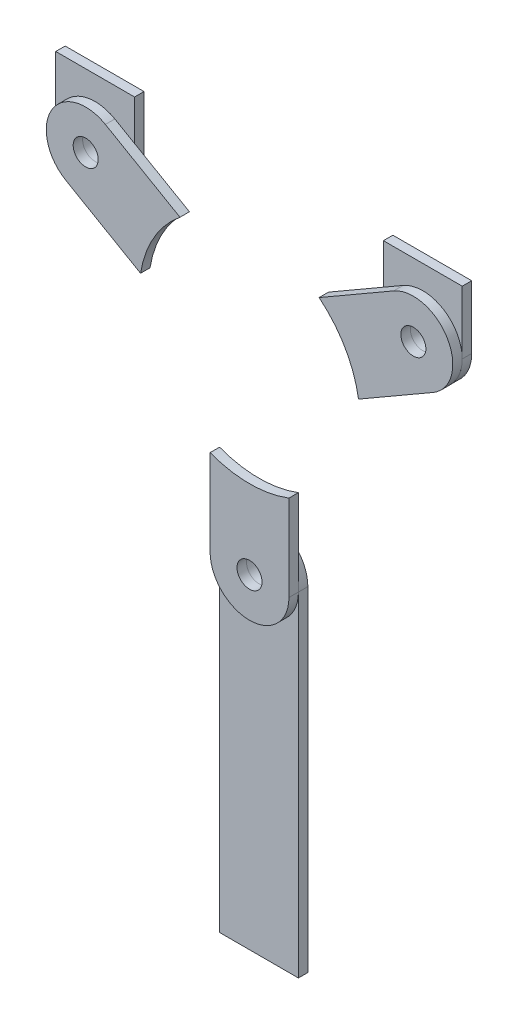
ISO-10303-21;
HEADER;
FILE_DESCRIPTION(('STEP AP214'),'2;1');
FILE_NAME('part.step','',(''),(''),'','','');
FILE_SCHEMA(('AUTOMOTIVE_DESIGN { 1 0 10303 214 1 1 1 1 }'));
ENDSEC;
DATA;
#1=APPLICATION_CONTEXT('core data for automotive mechanical design processes');
#2=APPLICATION_PROTOCOL_DEFINITION('international standard','automotive_design',2000,#1);
#3=PRODUCT_CONTEXT('',#1,'mechanical');
#4=PRODUCT('Part','Part','',(#3));
#5=PRODUCT_RELATED_PRODUCT_CATEGORY('part','',(#4));
#6=PRODUCT_DEFINITION_FORMATION('','',#4);
#7=PRODUCT_DEFINITION_CONTEXT('part definition',#1,'design');
#8=PRODUCT_DEFINITION('design','',#6,#7);
#9=PRODUCT_DEFINITION_SHAPE('','',#8);
#10=(LENGTH_UNIT() NAMED_UNIT(*) SI_UNIT(.MILLI.,.METRE.));
#11=(NAMED_UNIT(*) PLANE_ANGLE_UNIT() SI_UNIT($,.RADIAN.));
#12=(NAMED_UNIT(*) SI_UNIT($,.STERADIAN.) SOLID_ANGLE_UNIT());
#13=UNCERTAINTY_MEASURE_WITH_UNIT(LENGTH_MEASURE(1.E-05),#10,'distance_accuracy_value','');
#14=(GEOMETRIC_REPRESENTATION_CONTEXT(3) GLOBAL_UNCERTAINTY_ASSIGNED_CONTEXT((#13)) GLOBAL_UNIT_ASSIGNED_CONTEXT((#10,
#11,#12)) REPRESENTATION_CONTEXT('',''));
#15=CARTESIAN_POINT('',(0.,0.,0.));
#16=DIRECTION('',(0.,0.,1.));
#17=DIRECTION('',(1.,0.,0.));
#18=AXIS2_PLACEMENT_3D('',#15,#16,#17);
#19=CARTESIAN_POINT('',(0.,-60.,-3.));
#20=DIRECTION('',(0.,0.,1.));
#21=DIRECTION('',(1.,0.,0.));
#22=AXIS2_PLACEMENT_3D('',#19,#20,#21);
#23=CYLINDRICAL_SURFACE('',#22,12.5);
#24=CARTESIAN_POINT('',(0.,-60.,0.));
#25=DIRECTION('',(0.,0.,1.));
#26=DIRECTION('',(-1.,0.,0.));
#27=AXIS2_PLACEMENT_3D('',#24,#25,#26);
#28=CIRCLE('',#27,12.5);
#29=CARTESIAN_POINT('',(12.5000000000003,-59.9999999999999,0.));
#30=VERTEX_POINT('',#29);
#31=CARTESIAN_POINT('',(-12.4999999999997,-60.0000000000001,0.));
#32=VERTEX_POINT('',#31);
#33=EDGE_CURVE('E112',#30,#32,#28,.T.);
#34=ORIENTED_EDGE('',*,*,#33,.F.);
#35=DIRECTION('',(0.,0.,1.));
#36=VECTOR('',#35,1.);
#37=CARTESIAN_POINT('',(12.5000000000003,-59.9999999999999,-3.));
#38=LINE('',#37,#36);
#39=CARTESIAN_POINT('',(12.5000000000003,-59.9999999999999,-3.));
#40=VERTEX_POINT('',#39);
#41=EDGE_CURVE('E12',#40,#30,#38,.T.);
#42=ORIENTED_EDGE('',*,*,#41,.F.);
#43=CARTESIAN_POINT('',(0.,-60.,-3.));
#44=DIRECTION('',(0.,0.,1.));
#45=DIRECTION('',(-1.,0.,0.));
#46=AXIS2_PLACEMENT_3D('',#43,#44,#45);
#47=CIRCLE('',#46,12.5);
#48=CARTESIAN_POINT('',(-12.4999999999997,-60.0000000000001,-3.));
#49=VERTEX_POINT('',#48);
#50=EDGE_CURVE('E105',#40,#49,#47,.T.);
#51=ORIENTED_EDGE('',*,*,#50,.T.);
#52=DIRECTION('',(0.,0.,1.));
#53=VECTOR('',#52,1.);
#54=CARTESIAN_POINT('',(-12.4999999999997,-60.0000000000001,-3.));
#55=LINE('',#54,#53);
#56=EDGE_CURVE('E50',#49,#32,#55,.T.);
#57=ORIENTED_EDGE('',*,*,#56,.T.);
#58=EDGE_LOOP('',(#34,#42,#51,#57));
#59=FACE_BOUND('',#58,.T.);
#60=ADVANCED_FACE('F47',(#59),#23,.T.);
#61=CARTESIAN_POINT('',(12.5000000000003,-166.,-3.));
#62=DIRECTION('',(1.,0.,0.));
#63=DIRECTION('',(0.,0.,-1.));
#64=AXIS2_PLACEMENT_3D('',#61,#62,#63);
#65=PLANE('',#64);
#66=DIRECTION('',(0.,1.,0.));
#67=VECTOR('',#66,1.);
#68=CARTESIAN_POINT('',(12.5000000000003,-166.,0.));
#69=LINE('',#68,#67);
#70=CARTESIAN_POINT('',(12.5000000000003,-166.,0.));
#71=VERTEX_POINT('',#70);
#72=EDGE_CURVE('E107',#71,#30,#69,.T.);
#73=ORIENTED_EDGE('',*,*,#72,.F.);
#74=DIRECTION('',(0.,0.,1.));
#75=VECTOR('',#74,1.);
#76=CARTESIAN_POINT('',(12.5000000000003,-166.,-3.));
#77=LINE('',#76,#75);
#78=CARTESIAN_POINT('',(12.5000000000003,-166.,-3.));
#79=VERTEX_POINT('',#78);
#80=EDGE_CURVE('E56',#79,#71,#77,.T.);
#81=ORIENTED_EDGE('',*,*,#80,.F.);
#82=DIRECTION('',(0.,1.,0.));
#83=VECTOR('',#82,1.);
#84=CARTESIAN_POINT('',(12.5000000000003,-166.,-3.));
#85=LINE('',#84,#83);
#86=EDGE_CURVE('E102',#79,#40,#85,.T.);
#87=ORIENTED_EDGE('',*,*,#86,.T.);
#88=ORIENTED_EDGE('',*,*,#41,.T.);
#89=EDGE_LOOP('',(#73,#81,#87,#88));
#90=FACE_BOUND('',#89,.T.);
#91=ADVANCED_FACE('F123',(#90),#65,.T.);
#92=CARTESIAN_POINT('',(-12.4999999999997,-166.,-3.));
#93=DIRECTION('',(0.,-1.,0.));
#94=DIRECTION('',(0.,0.,-1.));
#95=AXIS2_PLACEMENT_3D('',#92,#93,#94);
#96=PLANE('',#95);
#97=DIRECTION('',(1.,0.,0.));
#98=VECTOR('',#97,1.);
#99=CARTESIAN_POINT('',(-12.4999999999997,-166.,0.));
#100=LINE('',#99,#98);
#101=CARTESIAN_POINT('',(-12.4999999999997,-166.,0.));
#102=VERTEX_POINT('',#101);
#103=EDGE_CURVE('E97',#102,#71,#100,.T.);
#104=ORIENTED_EDGE('',*,*,#103,.F.);
#105=DIRECTION('',(0.,0.,1.));
#106=VECTOR('',#105,1.);
#107=CARTESIAN_POINT('',(-12.4999999999997,-166.,-3.));
#108=LINE('',#107,#106);
#109=CARTESIAN_POINT('',(-12.4999999999997,-166.,-3.));
#110=VERTEX_POINT('',#109);
#111=EDGE_CURVE('E92',#110,#102,#108,.T.);
#112=ORIENTED_EDGE('',*,*,#111,.F.);
#113=DIRECTION('',(1.,0.,0.));
#114=VECTOR('',#113,1.);
#115=CARTESIAN_POINT('',(-12.4999999999997,-166.,-3.));
#116=LINE('',#115,#114);
#117=EDGE_CURVE('E95',#110,#79,#116,.T.);
#118=ORIENTED_EDGE('',*,*,#117,.T.);
#119=ORIENTED_EDGE('',*,*,#80,.T.);
#120=EDGE_LOOP('',(#104,#112,#118,#119));
#121=FACE_BOUND('',#120,.T.);
#122=ADVANCED_FACE('F94',(#121),#96,.T.);
#123=CARTESIAN_POINT('',(-12.4999999999997,-60.0000000000001,-3.));
#124=DIRECTION('',(-1.,0.,0.));
#125=DIRECTION('',(0.,-1.,0.));
#126=AXIS2_PLACEMENT_3D('',#123,#124,#125);
#127=PLANE('',#126);
#128=DIRECTION('',(0.,-1.,0.));
#129=VECTOR('',#128,1.);
#130=CARTESIAN_POINT('',(-12.4999999999997,-60.0000000000001,0.));
#131=LINE('',#130,#129);
#132=EDGE_CURVE('E115',#32,#102,#131,.T.);
#133=ORIENTED_EDGE('',*,*,#132,.F.);
#134=ORIENTED_EDGE('',*,*,#56,.F.);
#135=DIRECTION('',(0.,-1.,0.));
#136=VECTOR('',#135,1.);
#137=CARTESIAN_POINT('',(-12.4999999999997,-60.0000000000001,-3.));
#138=LINE('',#137,#136);
#139=EDGE_CURVE('E101',#49,#110,#138,.T.);
#140=ORIENTED_EDGE('',*,*,#139,.T.);
#141=ORIENTED_EDGE('',*,*,#111,.T.);
#142=EDGE_LOOP('',(#133,#134,#140,#141));
#143=FACE_BOUND('',#142,.T.);
#144=ADVANCED_FACE('F104',(#143),#127,.T.);
#145=CARTESIAN_POINT('',(0.,-60.,-3.));
#146=DIRECTION('',(0.,0.,-1.));
#147=DIRECTION('',(-1.,0.,0.));
#148=AXIS2_PLACEMENT_3D('',#145,#146,#147);
#149=PLANE('',#148);
#150=CARTESIAN_POINT('',(0.,-60.,-3.));
#151=DIRECTION('',(0.,0.,1.));
#152=DIRECTION('',(1.,0.,0.));
#153=AXIS2_PLACEMENT_3D('',#150,#151,#152);
#154=CIRCLE('',#153,3.96875);
#155=CARTESIAN_POINT('',(3.96875000000002,-60.,-3.));
#156=VERTEX_POINT('',#155);
#157=EDGE_CURVE('E116',#156,#156,#154,.T.);
#158=ORIENTED_EDGE('',*,*,#157,.T.);
#159=EDGE_LOOP('',(#158));
#160=FACE_BOUND('',#159,.T.);
#161=ORIENTED_EDGE('',*,*,#50,.F.);
#162=ORIENTED_EDGE('',*,*,#86,.F.);
#163=ORIENTED_EDGE('',*,*,#117,.F.);
#164=ORIENTED_EDGE('',*,*,#139,.F.);
#165=EDGE_LOOP('',(#161,#162,#163,#164));
#166=FACE_BOUND('',#165,.T.);
#167=ADVANCED_FACE('F100',(#160,#166),#149,.T.);
#168=CARTESIAN_POINT('',(0.,-60.,0.));
#169=DIRECTION('',(0.,0.,-1.));
#170=DIRECTION('',(-1.,0.,0.));
#171=AXIS2_PLACEMENT_3D('',#168,#169,#170);
#172=PLANE('',#171);
#173=CARTESIAN_POINT('',(0.,-60.,0.));
#174=DIRECTION('',(0.,0.,1.));
#175=DIRECTION('',(1.,0.,0.));
#176=AXIS2_PLACEMENT_3D('',#173,#174,#175);
#177=CIRCLE('',#176,3.96875);
#178=CARTESIAN_POINT('',(3.96875000000002,-60.,0.));
#179=VERTEX_POINT('',#178);
#180=EDGE_CURVE('E153',#179,#179,#177,.T.);
#181=ORIENTED_EDGE('',*,*,#180,.F.);
#182=EDGE_LOOP('',(#181));
#183=FACE_BOUND('',#182,.T.);
#184=ORIENTED_EDGE('',*,*,#33,.T.);
#185=ORIENTED_EDGE('',*,*,#132,.T.);
#186=ORIENTED_EDGE('',*,*,#103,.T.);
#187=ORIENTED_EDGE('',*,*,#72,.T.);
#188=EDGE_LOOP('',(#184,#185,#186,#187));
#189=FACE_BOUND('',#188,.T.);
#190=ADVANCED_FACE('F122',(#183,#189),#172,.F.);
#191=CARTESIAN_POINT('',(0.,-60.,-3.));
#192=DIRECTION('',(0.,0.,1.));
#193=DIRECTION('',(1.,0.,0.));
#194=AXIS2_PLACEMENT_3D('',#191,#192,#193);
#195=CYLINDRICAL_SURFACE('',#194,3.96875);
#196=ORIENTED_EDGE('',*,*,#157,.F.);
#197=EDGE_LOOP('',(#196));
#198=FACE_BOUND('',#197,.T.);
#199=ORIENTED_EDGE('',*,*,#180,.T.);
#200=EDGE_LOOP('',(#199));
#201=FACE_BOUND('',#200,.T.);
#202=ADVANCED_FACE('F141',(#198,#201),#195,.F.);
#203=CLOSED_SHELL('',(#60,#91,#122,#144,#167,#190,#202));
#204=MANIFOLD_SOLID_BREP('B2',#203);
#205=CARTESIAN_POINT('',(51.9615242270662,30.0000000000003,-3.));
#206=DIRECTION('',(0.,0.,1.));
#207=DIRECTION('',(1.,0.,0.));
#208=AXIS2_PLACEMENT_3D('',#205,#206,#207);
#209=CYLINDRICAL_SURFACE('',#208,12.5);
#210=CARTESIAN_POINT('',(51.9615242270662,30.0000000000003,0.));
#211=DIRECTION('',(0.,0.,1.));
#212=DIRECTION('',(1.,0.,0.));
#213=AXIS2_PLACEMENT_3D('',#210,#211,#212);
#214=CIRCLE('',#213,12.5);
#215=CARTESIAN_POINT('',(39.4615242270662,30.0000000000002,0.));
#216=VERTEX_POINT('',#215);
#217=CARTESIAN_POINT('',(64.4615242270662,30.0000000000002,0.));
#218=VERTEX_POINT('',#217);
#219=EDGE_CURVE('E266',#216,#218,#214,.T.);
#220=ORIENTED_EDGE('',*,*,#219,.F.);
#221=DIRECTION('',(0.,0.,1.));
#222=VECTOR('',#221,1.);
#223=CARTESIAN_POINT('',(39.4615242270662,30.0000000000002,-3.));
#224=LINE('',#223,#222);
#225=CARTESIAN_POINT('',(39.4615242270662,30.0000000000002,-3.));
#226=VERTEX_POINT('',#225);
#227=EDGE_CURVE('E45',#226,#216,#224,.T.);
#228=ORIENTED_EDGE('',*,*,#227,.F.);
#229=CARTESIAN_POINT('',(51.9615242270662,30.0000000000003,-3.));
#230=DIRECTION('',(0.,0.,1.));
#231=DIRECTION('',(1.,0.,0.));
#232=AXIS2_PLACEMENT_3D('',#229,#230,#231);
#233=CIRCLE('',#232,12.5);
#234=CARTESIAN_POINT('',(64.4615242270662,30.0000000000002,-3.));
#235=VERTEX_POINT('',#234);
#236=EDGE_CURVE('E259',#226,#235,#233,.T.);
#237=ORIENTED_EDGE('',*,*,#236,.T.);
#238=DIRECTION('',(0.,0.,1.));
#239=VECTOR('',#238,1.);
#240=CARTESIAN_POINT('',(64.4615242270662,30.0000000000002,-3.));
#241=LINE('',#240,#239);
#242=EDGE_CURVE('E204',#235,#218,#241,.T.);
#243=ORIENTED_EDGE('',*,*,#242,.T.);
#244=EDGE_LOOP('',(#220,#228,#237,#243));
#245=FACE_BOUND('',#244,.T.);
#246=ADVANCED_FACE('F201',(#245),#209,.T.);
#247=CARTESIAN_POINT('',(39.4615242270662,30.0000000000002,-3.));
#248=DIRECTION('',(-1.,0.,0.));
#249=DIRECTION('',(0.,0.,1.));
#250=AXIS2_PLACEMENT_3D('',#247,#248,#249);
#251=PLANE('',#250);
#252=DIRECTION('',(0.,-1.,0.));
#253=VECTOR('',#252,1.);
#254=CARTESIAN_POINT('',(39.4615242270662,30.0000000000002,0.));
#255=LINE('',#254,#253);
#256=CARTESIAN_POINT('',(39.4615242270662,50.0000000000002,0.));
#257=VERTEX_POINT('',#256);
#258=EDGE_CURVE('E261',#257,#216,#255,.T.);
#259=ORIENTED_EDGE('',*,*,#258,.F.);
#260=DIRECTION('',(0.,0.,1.));
#261=VECTOR('',#260,1.);
#262=CARTESIAN_POINT('',(39.4615242270662,50.0000000000002,-3.));
#263=LINE('',#262,#261);
#264=CARTESIAN_POINT('',(39.4615242270662,50.0000000000002,-3.));
#265=VERTEX_POINT('',#264);
#266=EDGE_CURVE('E210',#265,#257,#263,.T.);
#267=ORIENTED_EDGE('',*,*,#266,.F.);
#268=DIRECTION('',(0.,-1.,0.));
#269=VECTOR('',#268,1.);
#270=CARTESIAN_POINT('',(39.4615242270662,30.0000000000002,-3.));
#271=LINE('',#270,#269);
#272=EDGE_CURVE('E256',#265,#226,#271,.T.);
#273=ORIENTED_EDGE('',*,*,#272,.T.);
#274=ORIENTED_EDGE('',*,*,#227,.T.);
#275=EDGE_LOOP('',(#259,#267,#273,#274));
#276=FACE_BOUND('',#275,.T.);
#277=ADVANCED_FACE('F277',(#276),#251,.T.);
#278=CARTESIAN_POINT('',(64.4615242270662,50.0000000000002,-3.));
#279=DIRECTION('',(0.,1.,0.));
#280=DIRECTION('',(0.,0.,1.));
#281=AXIS2_PLACEMENT_3D('',#278,#279,#280);
#282=PLANE('',#281);
#283=DIRECTION('',(-1.,0.,0.));
#284=VECTOR('',#283,1.);
#285=CARTESIAN_POINT('',(64.4615242270662,50.0000000000002,0.));
#286=LINE('',#285,#284);
#287=CARTESIAN_POINT('',(64.4615242270662,50.0000000000002,0.));
#288=VERTEX_POINT('',#287);
#289=EDGE_CURVE('E251',#288,#257,#286,.T.);
#290=ORIENTED_EDGE('',*,*,#289,.F.);
#291=DIRECTION('',(0.,0.,1.));
#292=VECTOR('',#291,1.);
#293=CARTESIAN_POINT('',(64.4615242270662,50.0000000000002,-3.));
#294=LINE('',#293,#292);
#295=CARTESIAN_POINT('',(64.4615242270662,50.0000000000002,-3.));
#296=VERTEX_POINT('',#295);
#297=EDGE_CURVE('E246',#296,#288,#294,.T.);
#298=ORIENTED_EDGE('',*,*,#297,.F.);
#299=DIRECTION('',(-1.,0.,0.));
#300=VECTOR('',#299,1.);
#301=CARTESIAN_POINT('',(64.4615242270662,50.0000000000002,-3.));
#302=LINE('',#301,#300);
#303=EDGE_CURVE('E249',#296,#265,#302,.T.);
#304=ORIENTED_EDGE('',*,*,#303,.T.);
#305=ORIENTED_EDGE('',*,*,#266,.T.);
#306=EDGE_LOOP('',(#290,#298,#304,#305));
#307=FACE_BOUND('',#306,.T.);
#308=ADVANCED_FACE('F248',(#307),#282,.T.);
#309=CARTESIAN_POINT('',(64.4615242270662,30.0000000000002,-3.));
#310=DIRECTION('',(1.,0.,0.));
#311=DIRECTION('',(0.,0.,-1.));
#312=AXIS2_PLACEMENT_3D('',#309,#310,#311);
#313=PLANE('',#312);
#314=DIRECTION('',(0.,1.,0.));
#315=VECTOR('',#314,1.);
#316=CARTESIAN_POINT('',(64.4615242270662,30.0000000000002,0.));
#317=LINE('',#316,#315);
#318=EDGE_CURVE('E269',#218,#288,#317,.T.);
#319=ORIENTED_EDGE('',*,*,#318,.F.);
#320=ORIENTED_EDGE('',*,*,#242,.F.);
#321=DIRECTION('',(0.,1.,0.));
#322=VECTOR('',#321,1.);
#323=CARTESIAN_POINT('',(64.4615242270662,30.0000000000002,-3.));
#324=LINE('',#323,#322);
#325=EDGE_CURVE('E255',#235,#296,#324,.T.);
#326=ORIENTED_EDGE('',*,*,#325,.T.);
#327=ORIENTED_EDGE('',*,*,#297,.T.);
#328=EDGE_LOOP('',(#319,#320,#326,#327));
#329=FACE_BOUND('',#328,.T.);
#330=ADVANCED_FACE('F258',(#329),#313,.T.);
#331=CARTESIAN_POINT('',(51.9615242270662,30.0000000000003,-3.));
#332=DIRECTION('',(0.,0.,1.));
#333=DIRECTION('',(1.,0.,0.));
#334=AXIS2_PLACEMENT_3D('',#331,#332,#333);
#335=PLANE('',#334);
#336=CARTESIAN_POINT('',(51.9615242270662,30.0000000000003,-3.));
#337=DIRECTION('',(0.,0.,1.));
#338=DIRECTION('',(1.,0.,0.));
#339=AXIS2_PLACEMENT_3D('',#336,#337,#338);
#340=CIRCLE('',#339,3.96875);
#341=CARTESIAN_POINT('',(55.9302742270662,30.0000000000003,-3.));
#342=VERTEX_POINT('',#341);
#343=EDGE_CURVE('E270',#342,#342,#340,.T.);
#344=ORIENTED_EDGE('',*,*,#343,.T.);
#345=EDGE_LOOP('',(#344));
#346=FACE_BOUND('',#345,.T.);
#347=ORIENTED_EDGE('',*,*,#236,.F.);
#348=ORIENTED_EDGE('',*,*,#272,.F.);
#349=ORIENTED_EDGE('',*,*,#303,.F.);
#350=ORIENTED_EDGE('',*,*,#325,.F.);
#351=EDGE_LOOP('',(#347,#348,#349,#350));
#352=FACE_BOUND('',#351,.T.);
#353=ADVANCED_FACE('F254',(#346,#352),#335,.F.);
#354=CARTESIAN_POINT('',(51.9615242270662,30.0000000000003,0.));
#355=DIRECTION('',(0.,0.,1.));
#356=DIRECTION('',(1.,0.,0.));
#357=AXIS2_PLACEMENT_3D('',#354,#355,#356);
#358=PLANE('',#357);
#359=CARTESIAN_POINT('',(51.9615242270662,30.0000000000003,0.));
#360=DIRECTION('',(0.,0.,1.));
#361=DIRECTION('',(1.,0.,0.));
#362=AXIS2_PLACEMENT_3D('',#359,#360,#361);
#363=CIRCLE('',#362,3.96875);
#364=CARTESIAN_POINT('',(55.9302742270662,30.0000000000003,0.));
#365=VERTEX_POINT('',#364);
#366=EDGE_CURVE('E307',#365,#365,#363,.T.);
#367=ORIENTED_EDGE('',*,*,#366,.F.);
#368=EDGE_LOOP('',(#367));
#369=FACE_BOUND('',#368,.T.);
#370=ORIENTED_EDGE('',*,*,#219,.T.);
#371=ORIENTED_EDGE('',*,*,#318,.T.);
#372=ORIENTED_EDGE('',*,*,#289,.T.);
#373=ORIENTED_EDGE('',*,*,#258,.T.);
#374=EDGE_LOOP('',(#370,#371,#372,#373));
#375=FACE_BOUND('',#374,.T.);
#376=ADVANCED_FACE('F276',(#369,#375),#358,.T.);
#377=CARTESIAN_POINT('',(51.9615242270662,30.0000000000003,-3.));
#378=DIRECTION('',(0.,0.,1.));
#379=DIRECTION('',(1.,0.,0.));
#380=AXIS2_PLACEMENT_3D('',#377,#378,#379);
#381=CYLINDRICAL_SURFACE('',#380,3.96875);
#382=ORIENTED_EDGE('',*,*,#343,.F.);
#383=EDGE_LOOP('',(#382));
#384=FACE_BOUND('',#383,.T.);
#385=ORIENTED_EDGE('',*,*,#366,.T.);
#386=EDGE_LOOP('',(#385));
#387=FACE_BOUND('',#386,.T.);
#388=ADVANCED_FACE('F295',(#384,#387),#381,.F.);
#389=CLOSED_SHELL('',(#246,#277,#308,#330,#353,#376,#388));
#390=MANIFOLD_SOLID_BREP('B6',#389);
#391=CARTESIAN_POINT('',(-51.9615242270662,30.0000000000002,-3.));
#392=DIRECTION('',(0.,0.,1.));
#393=DIRECTION('',(1.,0.,0.));
#394=AXIS2_PLACEMENT_3D('',#391,#392,#393);
#395=CYLINDRICAL_SURFACE('',#394,12.5);
#396=CARTESIAN_POINT('',(-51.9615242270662,30.0000000000002,0.));
#397=DIRECTION('',(0.,0.,1.));
#398=DIRECTION('',(-1.,0.,0.));
#399=AXIS2_PLACEMENT_3D('',#396,#397,#398);
#400=CIRCLE('',#399,12.5);
#401=CARTESIAN_POINT('',(-64.4615242270662,30.0000000000002,0.));
#402=VERTEX_POINT('',#401);
#403=CARTESIAN_POINT('',(-39.4615242270662,30.0000000000002,0.));
#404=VERTEX_POINT('',#403);
#405=EDGE_CURVE('E420',#402,#404,#400,.T.);
#406=ORIENTED_EDGE('',*,*,#405,.F.);
#407=DIRECTION('',(0.,0.,1.));
#408=VECTOR('',#407,1.);
#409=CARTESIAN_POINT('',(-64.4615242270662,30.0000000000002,-3.));
#410=LINE('',#409,#408);
#411=CARTESIAN_POINT('',(-64.4615242270662,30.0000000000002,-3.));
#412=VERTEX_POINT('',#411);
#413=EDGE_CURVE('E199',#412,#402,#410,.T.);
#414=ORIENTED_EDGE('',*,*,#413,.F.);
#415=CARTESIAN_POINT('',(-51.9615242270662,30.0000000000002,-3.));
#416=DIRECTION('',(0.,0.,1.));
#417=DIRECTION('',(-1.,0.,0.));
#418=AXIS2_PLACEMENT_3D('',#415,#416,#417);
#419=CIRCLE('',#418,12.5);
#420=CARTESIAN_POINT('',(-39.4615242270662,30.0000000000002,-3.));
#421=VERTEX_POINT('',#420);
#422=EDGE_CURVE('E413',#412,#421,#419,.T.);
#423=ORIENTED_EDGE('',*,*,#422,.T.);
#424=DIRECTION('',(0.,0.,1.));
#425=VECTOR('',#424,1.);
#426=CARTESIAN_POINT('',(-39.4615242270662,30.0000000000002,-3.));
#427=LINE('',#426,#425);
#428=EDGE_CURVE('E358',#421,#404,#427,.T.);
#429=ORIENTED_EDGE('',*,*,#428,.T.);
#430=EDGE_LOOP('',(#406,#414,#423,#429));
#431=FACE_BOUND('',#430,.T.);
#432=ADVANCED_FACE('F355',(#431),#395,.T.);
#433=CARTESIAN_POINT('',(-64.4615242270662,30.0000000000002,-3.));
#434=DIRECTION('',(-1.,0.,0.));
#435=DIRECTION('',(0.,0.,1.));
#436=AXIS2_PLACEMENT_3D('',#433,#434,#435);
#437=PLANE('',#436);
#438=DIRECTION('',(0.,-1.,0.));
#439=VECTOR('',#438,1.);
#440=CARTESIAN_POINT('',(-64.4615242270662,30.0000000000002,0.));
#441=LINE('',#440,#439);
#442=CARTESIAN_POINT('',(-64.4615242270662,50.0000000000002,0.));
#443=VERTEX_POINT('',#442);
#444=EDGE_CURVE('E415',#443,#402,#441,.T.);
#445=ORIENTED_EDGE('',*,*,#444,.F.);
#446=DIRECTION('',(0.,0.,1.));
#447=VECTOR('',#446,1.);
#448=CARTESIAN_POINT('',(-64.4615242270662,50.0000000000002,-3.));
#449=LINE('',#448,#447);
#450=CARTESIAN_POINT('',(-64.4615242270662,50.0000000000002,-3.));
#451=VERTEX_POINT('',#450);
#452=EDGE_CURVE('E364',#451,#443,#449,.T.);
#453=ORIENTED_EDGE('',*,*,#452,.F.);
#454=DIRECTION('',(0.,-1.,0.));
#455=VECTOR('',#454,1.);
#456=CARTESIAN_POINT('',(-64.4615242270662,30.0000000000002,-3.));
#457=LINE('',#456,#455);
#458=EDGE_CURVE('E410',#451,#412,#457,.T.);
#459=ORIENTED_EDGE('',*,*,#458,.T.);
#460=ORIENTED_EDGE('',*,*,#413,.T.);
#461=EDGE_LOOP('',(#445,#453,#459,#460));
#462=FACE_BOUND('',#461,.T.);
#463=ADVANCED_FACE('F431',(#462),#437,.T.);
#464=CARTESIAN_POINT('',(-64.4615242270662,50.0000000000002,-3.));
#465=DIRECTION('',(0.,1.,0.));
#466=DIRECTION('',(0.,0.,1.));
#467=AXIS2_PLACEMENT_3D('',#464,#465,#466);
#468=PLANE('',#467);
#469=DIRECTION('',(-1.,0.,0.));
#470=VECTOR('',#469,1.);
#471=CARTESIAN_POINT('',(-64.4615242270662,50.0000000000002,0.));
#472=LINE('',#471,#470);
#473=CARTESIAN_POINT('',(-39.4615242270662,50.0000000000002,0.));
#474=VERTEX_POINT('',#473);
#475=EDGE_CURVE('E405',#474,#443,#472,.T.);
#476=ORIENTED_EDGE('',*,*,#475,.F.);
#477=DIRECTION('',(0.,0.,1.));
#478=VECTOR('',#477,1.);
#479=CARTESIAN_POINT('',(-39.4615242270662,50.0000000000002,-3.));
#480=LINE('',#479,#478);
#481=CARTESIAN_POINT('',(-39.4615242270662,50.0000000000002,-3.));
#482=VERTEX_POINT('',#481);
#483=EDGE_CURVE('E400',#482,#474,#480,.T.);
#484=ORIENTED_EDGE('',*,*,#483,.F.);
#485=DIRECTION('',(-1.,0.,0.));
#486=VECTOR('',#485,1.);
#487=CARTESIAN_POINT('',(-64.4615242270662,50.0000000000002,-3.));
#488=LINE('',#487,#486);
#489=EDGE_CURVE('E403',#482,#451,#488,.T.);
#490=ORIENTED_EDGE('',*,*,#489,.T.);
#491=ORIENTED_EDGE('',*,*,#452,.T.);
#492=EDGE_LOOP('',(#476,#484,#490,#491));
#493=FACE_BOUND('',#492,.T.);
#494=ADVANCED_FACE('F402',(#493),#468,.T.);
#495=CARTESIAN_POINT('',(-39.4615242270662,30.0000000000002,-3.));
#496=DIRECTION('',(1.,0.,0.));
#497=DIRECTION('',(0.,0.,-1.));
#498=AXIS2_PLACEMENT_3D('',#495,#496,#497);
#499=PLANE('',#498);
#500=DIRECTION('',(0.,1.,0.));
#501=VECTOR('',#500,1.);
#502=CARTESIAN_POINT('',(-39.4615242270662,30.0000000000002,0.));
#503=LINE('',#502,#501);
#504=EDGE_CURVE('E423',#404,#474,#503,.T.);
#505=ORIENTED_EDGE('',*,*,#504,.F.);
#506=ORIENTED_EDGE('',*,*,#428,.F.);
#507=DIRECTION('',(0.,1.,0.));
#508=VECTOR('',#507,1.);
#509=CARTESIAN_POINT('',(-39.4615242270662,30.0000000000002,-3.));
#510=LINE('',#509,#508);
#511=EDGE_CURVE('E409',#421,#482,#510,.T.);
#512=ORIENTED_EDGE('',*,*,#511,.T.);
#513=ORIENTED_EDGE('',*,*,#483,.T.);
#514=EDGE_LOOP('',(#505,#506,#512,#513));
#515=FACE_BOUND('',#514,.T.);
#516=ADVANCED_FACE('F412',(#515),#499,.T.);
#517=CARTESIAN_POINT('',(-51.9615242270662,30.0000000000002,-3.));
#518=DIRECTION('',(0.,0.,-1.));
#519=DIRECTION('',(-1.,0.,0.));
#520=AXIS2_PLACEMENT_3D('',#517,#518,#519);
#521=PLANE('',#520);
#522=CARTESIAN_POINT('',(-51.9615242270662,30.0000000000002,-3.));
#523=DIRECTION('',(0.,0.,1.));
#524=DIRECTION('',(1.,0.,0.));
#525=AXIS2_PLACEMENT_3D('',#522,#523,#524);
#526=CIRCLE('',#525,3.96875);
#527=CARTESIAN_POINT('',(-47.9927742270662,30.0000000000002,-3.));
#528=VERTEX_POINT('',#527);
#529=EDGE_CURVE('E424',#528,#528,#526,.T.);
#530=ORIENTED_EDGE('',*,*,#529,.T.);
#531=EDGE_LOOP('',(#530));
#532=FACE_BOUND('',#531,.T.);
#533=ORIENTED_EDGE('',*,*,#422,.F.);
#534=ORIENTED_EDGE('',*,*,#458,.F.);
#535=ORIENTED_EDGE('',*,*,#489,.F.);
#536=ORIENTED_EDGE('',*,*,#511,.F.);
#537=EDGE_LOOP('',(#533,#534,#535,#536));
#538=FACE_BOUND('',#537,.T.);
#539=ADVANCED_FACE('F408',(#532,#538),#521,.T.);
#540=CARTESIAN_POINT('',(-51.9615242270662,30.0000000000002,0.));
#541=DIRECTION('',(0.,0.,-1.));
#542=DIRECTION('',(-1.,0.,0.));
#543=AXIS2_PLACEMENT_3D('',#540,#541,#542);
#544=PLANE('',#543);
#545=CARTESIAN_POINT('',(-51.9615242270662,30.0000000000002,0.));
#546=DIRECTION('',(0.,0.,1.));
#547=DIRECTION('',(1.,0.,0.));
#548=AXIS2_PLACEMENT_3D('',#545,#546,#547);
#549=CIRCLE('',#548,3.96875);
#550=CARTESIAN_POINT('',(-47.9927742270662,30.0000000000002,0.));
#551=VERTEX_POINT('',#550);
#552=EDGE_CURVE('E461',#551,#551,#549,.T.);
#553=ORIENTED_EDGE('',*,*,#552,.F.);
#554=EDGE_LOOP('',(#553));
#555=FACE_BOUND('',#554,.T.);
#556=ORIENTED_EDGE('',*,*,#405,.T.);
#557=ORIENTED_EDGE('',*,*,#504,.T.);
#558=ORIENTED_EDGE('',*,*,#475,.T.);
#559=ORIENTED_EDGE('',*,*,#444,.T.);
#560=EDGE_LOOP('',(#556,#557,#558,#559));
#561=FACE_BOUND('',#560,.T.);
#562=ADVANCED_FACE('F430',(#555,#561),#544,.F.);
#563=CARTESIAN_POINT('',(-51.9615242270662,30.0000000000002,-3.));
#564=DIRECTION('',(0.,0.,1.));
#565=DIRECTION('',(1.,0.,0.));
#566=AXIS2_PLACEMENT_3D('',#563,#564,#565);
#567=CYLINDRICAL_SURFACE('',#566,3.96875);
#568=ORIENTED_EDGE('',*,*,#529,.F.);
#569=EDGE_LOOP('',(#568));
#570=FACE_BOUND('',#569,.T.);
#571=ORIENTED_EDGE('',*,*,#552,.T.);
#572=EDGE_LOOP('',(#571));
#573=FACE_BOUND('',#572,.T.);
#574=ADVANCED_FACE('F449',(#570,#573),#567,.F.);
#575=CLOSED_SHELL('',(#432,#463,#494,#516,#539,#562,#574));
#576=MANIFOLD_SOLID_BREP('B39',#575);
#577=CARTESIAN_POINT('',(12.5,0.,3.));
#578=DIRECTION('',(-1.,0.,0.));
#579=DIRECTION('',(0.,-1.,0.));
#580=AXIS2_PLACEMENT_3D('',#577,#578,#579);
#581=PLANE('',#580);
#582=DIRECTION('',(0.,1.,0.));
#583=VECTOR('',#582,1.);
#584=CARTESIAN_POINT('',(12.5,0.,0.));
#585=LINE('',#584,#583);
#586=CARTESIAN_POINT('',(12.5000000000003,-60.,0.));
#587=VERTEX_POINT('',#586);
#588=CARTESIAN_POINT('',(12.5000000000002,-32.691742076555,0.));
#589=VERTEX_POINT('',#588);
#590=EDGE_CURVE('E576',#587,#589,#585,.T.);
#591=ORIENTED_EDGE('',*,*,#590,.T.);
#592=DIRECTION('',(0.,0.,-1.));
#593=VECTOR('',#592,1.);
#594=CARTESIAN_POINT('',(12.5000000000002,-32.691742076555,3.));
#595=LINE('',#594,#593);
#596=CARTESIAN_POINT('',(12.5000000000002,-32.691742076555,3.));
#597=VERTEX_POINT('',#596);
#598=EDGE_CURVE('E353',#597,#589,#595,.T.);
#599=ORIENTED_EDGE('',*,*,#598,.F.);
#600=DIRECTION('',(0.,1.,0.));
#601=VECTOR('',#600,1.);
#602=CARTESIAN_POINT('',(12.5,0.,3.));
#603=LINE('',#602,#601);
#604=CARTESIAN_POINT('',(12.5000000000003,-60.,3.));
#605=VERTEX_POINT('',#604);
#606=EDGE_CURVE('E559',#605,#597,#603,.T.);
#607=ORIENTED_EDGE('',*,*,#606,.F.);
#608=DIRECTION('',(0.,0.,-1.));
#609=VECTOR('',#608,1.);
#610=CARTESIAN_POINT('',(12.5000000000003,-60.,3.));
#611=LINE('',#610,#609);
#612=EDGE_CURVE('E526',#605,#587,#611,.T.);
#613=ORIENTED_EDGE('',*,*,#612,.T.);
#614=EDGE_LOOP('',(#591,#599,#607,#613));
#615=FACE_BOUND('',#614,.T.);
#616=ADVANCED_FACE('F509',(#615),#581,.F.);
#617=CARTESIAN_POINT('',(0.,0.,3.));
#618=DIRECTION('',(0.,0.,-1.));
#619=DIRECTION('',(-1.,0.,0.));
#620=AXIS2_PLACEMENT_3D('',#617,#618,#619);
#621=CYLINDRICAL_SURFACE('',#620,35.);
#622=CARTESIAN_POINT('',(0.,0.,0.));
#623=DIRECTION('',(0.,0.,1.));
#624=DIRECTION('',(1.,0.,0.));
#625=AXIS2_PLACEMENT_3D('',#622,#623,#624);
#626=CIRCLE('',#625,35.);
#627=CARTESIAN_POINT('',(-12.4999999999998,-32.6917420765551,0.));
#628=VERTEX_POINT('',#627);
#629=EDGE_CURVE('E564',#589,#628,#626,.F.);
#630=ORIENTED_EDGE('',*,*,#629,.T.);
#631=DIRECTION('',(0.,0.,-1.));
#632=VECTOR('',#631,1.);
#633=CARTESIAN_POINT('',(-12.4999999999998,-32.6917420765551,3.));
#634=LINE('',#633,#632);
#635=CARTESIAN_POINT('',(-12.4999999999998,-32.6917420765551,3.));
#636=VERTEX_POINT('',#635);
#637=EDGE_CURVE('E518',#636,#628,#634,.T.);
#638=ORIENTED_EDGE('',*,*,#637,.F.);
#639=CARTESIAN_POINT('',(0.,0.,3.));
#640=DIRECTION('',(0.,0.,1.));
#641=DIRECTION('',(1.,0.,0.));
#642=AXIS2_PLACEMENT_3D('',#639,#640,#641);
#643=CIRCLE('',#642,35.);
#644=EDGE_CURVE('E551',#597,#636,#643,.F.);
#645=ORIENTED_EDGE('',*,*,#644,.F.);
#646=ORIENTED_EDGE('',*,*,#598,.T.);
#647=EDGE_LOOP('',(#630,#638,#645,#646));
#648=FACE_BOUND('',#647,.T.);
#649=ADVANCED_FACE('F563',(#648),#621,.F.);
#650=CARTESIAN_POINT('',(-12.5,0.,3.));
#651=DIRECTION('',(-1.,0.,0.));
#652=DIRECTION('',(0.,-1.,0.));
#653=AXIS2_PLACEMENT_3D('',#650,#651,#652);
#654=PLANE('',#653);
#655=DIRECTION('',(0.,1.,0.));
#656=VECTOR('',#655,1.);
#657=CARTESIAN_POINT('',(-12.5,0.,0.));
#658=LINE('',#657,#656);
#659=CARTESIAN_POINT('',(-12.4999999999997,-60.0000000000001,0.));
#660=VERTEX_POINT('',#659);
#661=EDGE_CURVE('E579',#660,#628,#658,.T.);
#662=ORIENTED_EDGE('',*,*,#661,.F.);
#663=DIRECTION('',(0.,0.,-1.));
#664=VECTOR('',#663,1.);
#665=CARTESIAN_POINT('',(-12.4999999999997,-60.0000000000001,3.));
#666=LINE('',#665,#664);
#667=CARTESIAN_POINT('',(-12.4999999999997,-60.0000000000001,3.));
#668=VERTEX_POINT('',#667);
#669=EDGE_CURVE('E540',#668,#660,#666,.T.);
#670=ORIENTED_EDGE('',*,*,#669,.F.);
#671=DIRECTION('',(0.,1.,0.));
#672=VECTOR('',#671,1.);
#673=CARTESIAN_POINT('',(-12.5,0.,3.));
#674=LINE('',#673,#672);
#675=EDGE_CURVE('E558',#668,#636,#674,.T.);
#676=ORIENTED_EDGE('',*,*,#675,.T.);
#677=ORIENTED_EDGE('',*,*,#637,.T.);
#678=EDGE_LOOP('',(#662,#670,#676,#677));
#679=FACE_BOUND('',#678,.T.);
#680=ADVANCED_FACE('F567',(#679),#654,.T.);
#681=CARTESIAN_POINT('',(0.,-60.,3.));
#682=DIRECTION('',(0.,0.,-1.));
#683=DIRECTION('',(-1.,0.,0.));
#684=AXIS2_PLACEMENT_3D('',#681,#682,#683);
#685=CYLINDRICAL_SURFACE('',#684,3.96875);
#686=CARTESIAN_POINT('',(0.,-60.,3.));
#687=DIRECTION('',(0.,0.,1.));
#688=DIRECTION('',(1.,0.,0.));
#689=AXIS2_PLACEMENT_3D('',#686,#687,#688);
#690=CIRCLE('',#689,3.96875);
#691=CARTESIAN_POINT('',(3.96875000000002,-60.,3.));
#692=VERTEX_POINT('',#691);
#693=EDGE_CURVE('E584',#692,#692,#690,.T.);
#694=ORIENTED_EDGE('',*,*,#693,.T.);
#695=EDGE_LOOP('',(#694));
#696=FACE_BOUND('',#695,.T.);
#697=CARTESIAN_POINT('',(0.,-60.,0.));
#698=DIRECTION('',(0.,0.,1.));
#699=DIRECTION('',(1.,0.,0.));
#700=AXIS2_PLACEMENT_3D('',#697,#698,#699);
#701=CIRCLE('',#700,3.96875);
#702=CARTESIAN_POINT('',(3.96875000000002,-60.,0.));
#703=VERTEX_POINT('',#702);
#704=EDGE_CURVE('E573',#703,#703,#701,.T.);
#705=ORIENTED_EDGE('',*,*,#704,.F.);
#706=EDGE_LOOP('',(#705));
#707=FACE_BOUND('',#706,.T.);
#708=ADVANCED_FACE('F511',(#696,#707),#685,.F.);
#709=CARTESIAN_POINT('',(0.,-60.,3.));
#710=DIRECTION('',(0.,0.,-1.));
#711=DIRECTION('',(-1.,0.,0.));
#712=AXIS2_PLACEMENT_3D('',#709,#710,#711);
#713=CYLINDRICAL_SURFACE('',#712,12.5);
#714=CARTESIAN_POINT('',(0.,-60.,0.));
#715=DIRECTION('',(0.,0.,1.));
#716=DIRECTION('',(1.,0.,0.));
#717=AXIS2_PLACEMENT_3D('',#714,#715,#716);
#718=CIRCLE('',#717,12.5);
#719=EDGE_CURVE('E581',#587,#660,#718,.F.);
#720=ORIENTED_EDGE('',*,*,#719,.F.);
#721=ORIENTED_EDGE('',*,*,#612,.F.);
#722=CARTESIAN_POINT('',(0.,-60.,3.));
#723=DIRECTION('',(0.,0.,1.));
#724=DIRECTION('',(1.,0.,0.));
#725=AXIS2_PLACEMENT_3D('',#722,#723,#724);
#726=CIRCLE('',#725,12.5);
#727=EDGE_CURVE('E568',#605,#668,#726,.F.);
#728=ORIENTED_EDGE('',*,*,#727,.T.);
#729=ORIENTED_EDGE('',*,*,#669,.T.);
#730=EDGE_LOOP('',(#720,#721,#728,#729));
#731=FACE_BOUND('',#730,.T.);
#732=ADVANCED_FACE('F595',(#731),#713,.T.);
#733=CARTESIAN_POINT('',(0.,0.,3.));
#734=DIRECTION('',(0.,0.,1.));
#735=DIRECTION('',(1.,0.,0.));
#736=AXIS2_PLACEMENT_3D('',#733,#734,#735);
#737=PLANE('',#736);
#738=ORIENTED_EDGE('',*,*,#693,.F.);
#739=EDGE_LOOP('',(#738));
#740=FACE_BOUND('',#739,.T.);
#741=ORIENTED_EDGE('',*,*,#606,.T.);
#742=ORIENTED_EDGE('',*,*,#644,.T.);
#743=ORIENTED_EDGE('',*,*,#675,.F.);
#744=ORIENTED_EDGE('',*,*,#727,.F.);
#745=EDGE_LOOP('',(#741,#742,#743,#744));
#746=FACE_BOUND('',#745,.T.);
#747=ADVANCED_FACE('F555',(#740,#746),#737,.T.);
#748=CARTESIAN_POINT('',(0.,0.,0.));
#749=DIRECTION('',(0.,0.,1.));
#750=DIRECTION('',(1.,0.,0.));
#751=AXIS2_PLACEMENT_3D('',#748,#749,#750);
#752=PLANE('',#751);
#753=ORIENTED_EDGE('',*,*,#704,.T.);
#754=EDGE_LOOP('',(#753));
#755=FACE_BOUND('',#754,.T.);
#756=ORIENTED_EDGE('',*,*,#590,.F.);
#757=ORIENTED_EDGE('',*,*,#719,.T.);
#758=ORIENTED_EDGE('',*,*,#661,.T.);
#759=ORIENTED_EDGE('',*,*,#629,.F.);
#760=EDGE_LOOP('',(#756,#757,#758,#759));
#761=FACE_BOUND('',#760,.T.);
#762=ADVANCED_FACE('F594',(#755,#761),#752,.F.);
#763=CLOSED_SHELL('',(#616,#649,#680,#708,#732,#747,#762));
#764=MANIFOLD_SOLID_BREP('B193',#763);
#765=CARTESIAN_POINT('',(-6.25000000000005,10.8253175473054,3.));
#766=DIRECTION('',(0.500000000000005,-0.866025403784436,0.));
#767=DIRECTION('',(0.866025403784436,0.500000000000005,0.));
#768=AXIS2_PLACEMENT_3D('',#765,#766,#767);
#769=PLANE('',#768);
#770=DIRECTION('',(-0.866025403784436,-0.500000000000005,0.));
#771=VECTOR('',#770,1.);
#772=CARTESIAN_POINT('',(-6.25000000000005,10.8253175473054,0.));
#773=LINE('',#772,#771);
#774=CARTESIAN_POINT('',(45.7115242270661,40.8253175473057,0.));
#775=VERTEX_POINT('',#774);
#776=CARTESIAN_POINT('',(22.0618791322652,27.1711885855831,0.));
#777=VERTEX_POINT('',#776);
#778=EDGE_CURVE('E729',#775,#777,#773,.T.);
#779=ORIENTED_EDGE('',*,*,#778,.T.);
#780=DIRECTION('',(0.,0.,-1.));
#781=VECTOR('',#780,1.);
#782=CARTESIAN_POINT('',(22.0618791322652,27.1711885855831,3.));
#783=LINE('',#782,#781);
#784=CARTESIAN_POINT('',(22.0618791322652,27.1711885855831,3.));
#785=VERTEX_POINT('',#784);
#786=EDGE_CURVE('E507',#785,#777,#783,.T.);
#787=ORIENTED_EDGE('',*,*,#786,.F.);
#788=DIRECTION('',(-0.866025403784436,-0.500000000000005,0.));
#789=VECTOR('',#788,1.);
#790=CARTESIAN_POINT('',(-6.25000000000005,10.8253175473054,3.));
#791=LINE('',#790,#789);
#792=CARTESIAN_POINT('',(45.7115242270661,40.8253175473057,3.));
#793=VERTEX_POINT('',#792);
#794=EDGE_CURVE('E712',#793,#785,#791,.T.);
#795=ORIENTED_EDGE('',*,*,#794,.F.);
#796=DIRECTION('',(0.,0.,-1.));
#797=VECTOR('',#796,1.);
#798=CARTESIAN_POINT('',(45.7115242270661,40.8253175473057,3.));
#799=LINE('',#798,#797);
#800=EDGE_CURVE('E679',#793,#775,#799,.T.);
#801=ORIENTED_EDGE('',*,*,#800,.T.);
#802=EDGE_LOOP('',(#779,#787,#795,#801));
#803=FACE_BOUND('',#802,.T.);
#804=ADVANCED_FACE('F662',(#803),#769,.F.);
#805=CARTESIAN_POINT('',(0.,0.,3.));
#806=DIRECTION('',(0.,0.,-1.));
#807=DIRECTION('',(-1.,0.,0.));
#808=AXIS2_PLACEMENT_3D('',#805,#806,#807);
#809=CYLINDRICAL_SURFACE('',#808,35.);
#810=CARTESIAN_POINT('',(0.,0.,0.));
#811=DIRECTION('',(0.,0.,1.));
#812=DIRECTION('',(1.,0.,0.));
#813=AXIS2_PLACEMENT_3D('',#810,#811,#812);
#814=CIRCLE('',#813,35.);
#815=CARTESIAN_POINT('',(34.5618791322653,5.52055349097222,0.));
#816=VERTEX_POINT('',#815);
#817=EDGE_CURVE('E717',#777,#816,#814,.F.);
#818=ORIENTED_EDGE('',*,*,#817,.T.);
#819=DIRECTION('',(0.,0.,-1.));
#820=VECTOR('',#819,1.);
#821=CARTESIAN_POINT('',(34.5618791322653,5.52055349097222,3.));
#822=LINE('',#821,#820);
#823=CARTESIAN_POINT('',(34.5618791322653,5.52055349097222,3.));
#824=VERTEX_POINT('',#823);
#825=EDGE_CURVE('E671',#824,#816,#822,.T.);
#826=ORIENTED_EDGE('',*,*,#825,.F.);
#827=CARTESIAN_POINT('',(0.,0.,3.));
#828=DIRECTION('',(0.,0.,1.));
#829=DIRECTION('',(1.,0.,0.));
#830=AXIS2_PLACEMENT_3D('',#827,#828,#829);
#831=CIRCLE('',#830,35.);
#832=EDGE_CURVE('E704',#785,#824,#831,.F.);
#833=ORIENTED_EDGE('',*,*,#832,.F.);
#834=ORIENTED_EDGE('',*,*,#786,.T.);
#835=EDGE_LOOP('',(#818,#826,#833,#834));
#836=FACE_BOUND('',#835,.T.);
#837=ADVANCED_FACE('F716',(#836),#809,.F.);
#838=CARTESIAN_POINT('',(6.25000000000005,-10.8253175473055,3.));
#839=DIRECTION('',(0.500000000000004,-0.866025403784436,0.));
#840=DIRECTION('',(0.866025403784436,0.500000000000004,0.));
#841=AXIS2_PLACEMENT_3D('',#838,#839,#840);
#842=PLANE('',#841);
#843=DIRECTION('',(-0.866025403784436,-0.500000000000004,0.));
#844=VECTOR('',#843,1.);
#845=CARTESIAN_POINT('',(6.25000000000005,-10.8253175473055,0.));
#846=LINE('',#845,#844);
#847=CARTESIAN_POINT('',(58.2115242270662,19.1746824526948,0.));
#848=VERTEX_POINT('',#847);
#849=EDGE_CURVE('E732',#848,#816,#846,.T.);
#850=ORIENTED_EDGE('',*,*,#849,.F.);
#851=DIRECTION('',(0.,0.,-1.));
#852=VECTOR('',#851,1.);
#853=CARTESIAN_POINT('',(58.2115242270662,19.1746824526948,3.));
#854=LINE('',#853,#852);
#855=CARTESIAN_POINT('',(58.2115242270662,19.1746824526948,3.));
#856=VERTEX_POINT('',#855);
#857=EDGE_CURVE('E693',#856,#848,#854,.T.);
#858=ORIENTED_EDGE('',*,*,#857,.F.);
#859=DIRECTION('',(-0.866025403784436,-0.500000000000004,0.));
#860=VECTOR('',#859,1.);
#861=CARTESIAN_POINT('',(6.25000000000005,-10.8253175473055,3.));
#862=LINE('',#861,#860);
#863=EDGE_CURVE('E711',#856,#824,#862,.T.);
#864=ORIENTED_EDGE('',*,*,#863,.T.);
#865=ORIENTED_EDGE('',*,*,#825,.T.);
#866=EDGE_LOOP('',(#850,#858,#864,#865));
#867=FACE_BOUND('',#866,.T.);
#868=ADVANCED_FACE('F720',(#867),#842,.T.);
#869=CARTESIAN_POINT('',(51.9615242270662,30.0000000000003,3.));
#870=DIRECTION('',(0.,0.,-1.));
#871=DIRECTION('',(-1.,0.,0.));
#872=AXIS2_PLACEMENT_3D('',#869,#870,#871);
#873=CYLINDRICAL_SURFACE('',#872,3.96875);
#874=CARTESIAN_POINT('',(51.9615242270662,30.0000000000003,3.));
#875=DIRECTION('',(0.,0.,1.));
#876=DIRECTION('',(1.,0.,0.));
#877=AXIS2_PLACEMENT_3D('',#874,#875,#876);
#878=CIRCLE('',#877,3.96875);
#879=CARTESIAN_POINT('',(55.9302742270662,30.0000000000003,3.));
#880=VERTEX_POINT('',#879);
#881=EDGE_CURVE('E737',#880,#880,#878,.T.);
#882=ORIENTED_EDGE('',*,*,#881,.T.);
#883=EDGE_LOOP('',(#882));
#884=FACE_BOUND('',#883,.T.);
#885=CARTESIAN_POINT('',(51.9615242270662,30.0000000000003,0.));
#886=DIRECTION('',(0.,0.,1.));
#887=DIRECTION('',(1.,0.,0.));
#888=AXIS2_PLACEMENT_3D('',#885,#886,#887);
#889=CIRCLE('',#888,3.96875);
#890=CARTESIAN_POINT('',(55.9302742270662,30.0000000000003,0.));
#891=VERTEX_POINT('',#890);
#892=EDGE_CURVE('E726',#891,#891,#889,.T.);
#893=ORIENTED_EDGE('',*,*,#892,.F.);
#894=EDGE_LOOP('',(#893));
#895=FACE_BOUND('',#894,.T.);
#896=ADVANCED_FACE('F664',(#884,#895),#873,.F.);
#897=CARTESIAN_POINT('',(51.9615242270662,30.0000000000003,3.));
#898=DIRECTION('',(0.,0.,-1.));
#899=DIRECTION('',(-1.,0.,0.));
#900=AXIS2_PLACEMENT_3D('',#897,#898,#899);
#901=CYLINDRICAL_SURFACE('',#900,12.5);
#902=CARTESIAN_POINT('',(51.9615242270662,30.0000000000003,0.));
#903=DIRECTION('',(0.,0.,1.));
#904=DIRECTION('',(1.,0.,0.));
#905=AXIS2_PLACEMENT_3D('',#902,#903,#904);
#906=CIRCLE('',#905,12.5);
#907=EDGE_CURVE('E734',#775,#848,#906,.F.);
#908=ORIENTED_EDGE('',*,*,#907,.F.);
#909=ORIENTED_EDGE('',*,*,#800,.F.);
#910=CARTESIAN_POINT('',(51.9615242270662,30.0000000000003,3.));
#911=DIRECTION('',(0.,0.,1.));
#912=DIRECTION('',(1.,0.,0.));
#913=AXIS2_PLACEMENT_3D('',#910,#911,#912);
#914=CIRCLE('',#913,12.5);
#915=EDGE_CURVE('E721',#793,#856,#914,.F.);
#916=ORIENTED_EDGE('',*,*,#915,.T.);
#917=ORIENTED_EDGE('',*,*,#857,.T.);
#918=EDGE_LOOP('',(#908,#909,#916,#917));
#919=FACE_BOUND('',#918,.T.);
#920=ADVANCED_FACE('F748',(#919),#901,.T.);
#921=CARTESIAN_POINT('',(0.,0.,3.));
#922=DIRECTION('',(0.,0.,1.));
#923=DIRECTION('',(1.,0.,0.));
#924=AXIS2_PLACEMENT_3D('',#921,#922,#923);
#925=PLANE('',#924);
#926=ORIENTED_EDGE('',*,*,#881,.F.);
#927=EDGE_LOOP('',(#926));
#928=FACE_BOUND('',#927,.T.);
#929=ORIENTED_EDGE('',*,*,#794,.T.);
#930=ORIENTED_EDGE('',*,*,#832,.T.);
#931=ORIENTED_EDGE('',*,*,#863,.F.);
#932=ORIENTED_EDGE('',*,*,#915,.F.);
#933=EDGE_LOOP('',(#929,#930,#931,#932));
#934=FACE_BOUND('',#933,.T.);
#935=ADVANCED_FACE('F708',(#928,#934),#925,.T.);
#936=CARTESIAN_POINT('',(0.,0.,0.));
#937=DIRECTION('',(0.,0.,1.));
#938=DIRECTION('',(1.,0.,0.));
#939=AXIS2_PLACEMENT_3D('',#936,#937,#938);
#940=PLANE('',#939);
#941=ORIENTED_EDGE('',*,*,#892,.T.);
#942=EDGE_LOOP('',(#941));
#943=FACE_BOUND('',#942,.T.);
#944=ORIENTED_EDGE('',*,*,#778,.F.);
#945=ORIENTED_EDGE('',*,*,#907,.T.);
#946=ORIENTED_EDGE('',*,*,#849,.T.);
#947=ORIENTED_EDGE('',*,*,#817,.F.);
#948=EDGE_LOOP('',(#944,#945,#946,#947));
#949=FACE_BOUND('',#948,.T.);
#950=ADVANCED_FACE('F747',(#943,#949),#940,.F.);
#951=CLOSED_SHELL('',(#804,#837,#868,#896,#920,#935,#950));
#952=MANIFOLD_SOLID_BREP('B347',#951);
#953=CARTESIAN_POINT('',(-6.24999999999994,-10.8253175473055,3.));
#954=DIRECTION('',(0.499999999999995,0.866025403784441,0.));
#955=DIRECTION('',(-0.866025403784441,0.499999999999995,0.));
#956=AXIS2_PLACEMENT_3D('',#953,#954,#955);
#957=PLANE('',#956);
#958=DIRECTION('',(0.866025403784441,-0.499999999999995,0.));
#959=VECTOR('',#958,1.);
#960=CARTESIAN_POINT('',(-6.24999999999994,-10.8253175473055,0.));
#961=LINE('',#960,#959);
#962=CARTESIAN_POINT('',(-58.2115242270664,19.1746824526942,0.));
#963=VERTEX_POINT('',#962);
#964=CARTESIAN_POINT('',(-34.5618791322653,5.52055349097185,0.));
#965=VERTEX_POINT('',#964);
#966=EDGE_CURVE('E873',#963,#965,#961,.T.);
#967=ORIENTED_EDGE('',*,*,#966,.T.);
#968=DIRECTION('',(0.,0.,-1.));
#969=VECTOR('',#968,1.);
#970=CARTESIAN_POINT('',(-34.5618791322653,5.52055349097185,3.));
#971=LINE('',#970,#969);
#972=CARTESIAN_POINT('',(-34.5618791322653,5.52055349097185,3.));
#973=VERTEX_POINT('',#972);
#974=EDGE_CURVE('E660',#973,#965,#971,.T.);
#975=ORIENTED_EDGE('',*,*,#974,.F.);
#976=DIRECTION('',(0.866025403784441,-0.499999999999995,0.));
#977=VECTOR('',#976,1.);
#978=CARTESIAN_POINT('',(-6.24999999999994,-10.8253175473055,3.));
#979=LINE('',#978,#977);
#980=CARTESIAN_POINT('',(-58.2115242270664,19.1746824526942,3.));
#981=VERTEX_POINT('',#980);
#982=EDGE_CURVE('E856',#981,#973,#979,.T.);
#983=ORIENTED_EDGE('',*,*,#982,.F.);
#984=DIRECTION('',(0.,0.,-1.));
#985=VECTOR('',#984,1.);
#986=CARTESIAN_POINT('',(-58.2115242270664,19.1746824526942,3.));
#987=LINE('',#986,#985);
#988=EDGE_CURVE('E823',#981,#963,#987,.T.);
#989=ORIENTED_EDGE('',*,*,#988,.T.);
#990=EDGE_LOOP('',(#967,#975,#983,#989));
#991=FACE_BOUND('',#990,.T.);
#992=ADVANCED_FACE('F806',(#991),#957,.F.);
#993=CARTESIAN_POINT('',(0.,0.,3.));
#994=DIRECTION('',(0.,0.,-1.));
#995=DIRECTION('',(-1.,0.,0.));
#996=AXIS2_PLACEMENT_3D('',#993,#994,#995);
#997=CYLINDRICAL_SURFACE('',#996,35.);
#998=CARTESIAN_POINT('',(0.,0.,0.));
#999=DIRECTION('',(0.,0.,1.));
#1000=DIRECTION('',(1.,0.,0.));
#1001=AXIS2_PLACEMENT_3D('',#998,#999,#1000);
#1002=CIRCLE('',#1001,35.);
#1003=CARTESIAN_POINT('',(-22.0618791322654,27.1711885855829,0.));
#1004=VERTEX_POINT('',#1003);
#1005=EDGE_CURVE('E861',#965,#1004,#1002,.F.);
#1006=ORIENTED_EDGE('',*,*,#1005,.T.);
#1007=DIRECTION('',(0.,0.,-1.));
#1008=VECTOR('',#1007,1.);
#1009=CARTESIAN_POINT('',(-22.0618791322654,27.1711885855829,3.));
#1010=LINE('',#1009,#1008);
#1011=CARTESIAN_POINT('',(-22.0618791322654,27.1711885855829,3.));
#1012=VERTEX_POINT('',#1011);
#1013=EDGE_CURVE('E815',#1012,#1004,#1010,.T.);
#1014=ORIENTED_EDGE('',*,*,#1013,.F.);
#1015=CARTESIAN_POINT('',(0.,0.,3.));
#1016=DIRECTION('',(0.,0.,1.));
#1017=DIRECTION('',(1.,0.,0.));
#1018=AXIS2_PLACEMENT_3D('',#1015,#1016,#1017);
#1019=CIRCLE('',#1018,35.);
#1020=EDGE_CURVE('E848',#973,#1012,#1019,.F.);
#1021=ORIENTED_EDGE('',*,*,#1020,.F.);
#1022=ORIENTED_EDGE('',*,*,#974,.T.);
#1023=EDGE_LOOP('',(#1006,#1014,#1021,#1022));
#1024=FACE_BOUND('',#1023,.T.);
#1025=ADVANCED_FACE('F860',(#1024),#997,.F.);
#1026=CARTESIAN_POINT('',(6.24999999999996,10.8253175473056,3.));
#1027=DIRECTION('',(0.499999999999994,0.866025403784442,0.));
#1028=DIRECTION('',(-0.866025403784442,0.499999999999994,0.));
#1029=AXIS2_PLACEMENT_3D('',#1026,#1027,#1028);
#1030=PLANE('',#1029);
#1031=DIRECTION('',(0.866025403784442,-0.499999999999994,0.));
#1032=VECTOR('',#1031,1.);
#1033=CARTESIAN_POINT('',(6.24999999999996,10.8253175473056,0.));
#1034=LINE('',#1033,#1032);
#1035=CARTESIAN_POINT('',(-45.7115242270665,40.8253175473052,0.));
#1036=VERTEX_POINT('',#1035);
#1037=EDGE_CURVE('E876',#1036,#1004,#1034,.T.);
#1038=ORIENTED_EDGE('',*,*,#1037,.F.);
#1039=DIRECTION('',(0.,0.,-1.));
#1040=VECTOR('',#1039,1.);
#1041=CARTESIAN_POINT('',(-45.7115242270665,40.8253175473052,3.));
#1042=LINE('',#1041,#1040);
#1043=CARTESIAN_POINT('',(-45.7115242270665,40.8253175473052,3.));
#1044=VERTEX_POINT('',#1043);
#1045=EDGE_CURVE('E837',#1044,#1036,#1042,.T.);
#1046=ORIENTED_EDGE('',*,*,#1045,.F.);
#1047=DIRECTION('',(0.866025403784442,-0.499999999999994,0.));
#1048=VECTOR('',#1047,1.);
#1049=CARTESIAN_POINT('',(6.24999999999996,10.8253175473056,3.));
#1050=LINE('',#1049,#1048);
#1051=EDGE_CURVE('E855',#1044,#1012,#1050,.T.);
#1052=ORIENTED_EDGE('',*,*,#1051,.T.);
#1053=ORIENTED_EDGE('',*,*,#1013,.T.);
#1054=EDGE_LOOP('',(#1038,#1046,#1052,#1053));
#1055=FACE_BOUND('',#1054,.T.);
#1056=ADVANCED_FACE('F864',(#1055),#1030,.T.);
#1057=CARTESIAN_POINT('',(-51.9615242270662,30.0000000000002,3.));
#1058=DIRECTION('',(0.,0.,-1.));
#1059=DIRECTION('',(-1.,0.,0.));
#1060=AXIS2_PLACEMENT_3D('',#1057,#1058,#1059);
#1061=CYLINDRICAL_SURFACE('',#1060,3.96875);
#1062=CARTESIAN_POINT('',(-51.9615242270662,30.0000000000002,3.));
#1063=DIRECTION('',(0.,0.,1.));
#1064=DIRECTION('',(1.,0.,0.));
#1065=AXIS2_PLACEMENT_3D('',#1062,#1063,#1064);
#1066=CIRCLE('',#1065,3.96875);
#1067=CARTESIAN_POINT('',(-47.9927742270662,30.0000000000002,3.));
#1068=VERTEX_POINT('',#1067);
#1069=EDGE_CURVE('E881',#1068,#1068,#1066,.T.);
#1070=ORIENTED_EDGE('',*,*,#1069,.T.);
#1071=EDGE_LOOP('',(#1070));
#1072=FACE_BOUND('',#1071,.T.);
#1073=CARTESIAN_POINT('',(-51.9615242270662,30.0000000000002,0.));
#1074=DIRECTION('',(0.,0.,1.));
#1075=DIRECTION('',(1.,0.,0.));
#1076=AXIS2_PLACEMENT_3D('',#1073,#1074,#1075);
#1077=CIRCLE('',#1076,3.96875);
#1078=CARTESIAN_POINT('',(-47.9927742270662,30.0000000000002,0.));
#1079=VERTEX_POINT('',#1078);
#1080=EDGE_CURVE('E870',#1079,#1079,#1077,.T.);
#1081=ORIENTED_EDGE('',*,*,#1080,.F.);
#1082=EDGE_LOOP('',(#1081));
#1083=FACE_BOUND('',#1082,.T.);
#1084=ADVANCED_FACE('F808',(#1072,#1083),#1061,.F.);
#1085=CARTESIAN_POINT('',(-51.9615242270662,30.0000000000002,3.));
#1086=DIRECTION('',(0.,0.,-1.));
#1087=DIRECTION('',(-1.,0.,0.));
#1088=AXIS2_PLACEMENT_3D('',#1085,#1086,#1087);
#1089=CYLINDRICAL_SURFACE('',#1088,12.5);
#1090=CARTESIAN_POINT('',(-51.9615242270662,30.0000000000002,0.));
#1091=DIRECTION('',(0.,0.,1.));
#1092=DIRECTION('',(1.,0.,0.));
#1093=AXIS2_PLACEMENT_3D('',#1090,#1091,#1092);
#1094=CIRCLE('',#1093,12.5);
#1095=EDGE_CURVE('E878',#963,#1036,#1094,.F.);
#1096=ORIENTED_EDGE('',*,*,#1095,.F.);
#1097=ORIENTED_EDGE('',*,*,#988,.F.);
#1098=CARTESIAN_POINT('',(-51.9615242270662,30.0000000000002,3.));
#1099=DIRECTION('',(0.,0.,1.));
#1100=DIRECTION('',(1.,0.,0.));
#1101=AXIS2_PLACEMENT_3D('',#1098,#1099,#1100);
#1102=CIRCLE('',#1101,12.5);
#1103=EDGE_CURVE('E865',#981,#1044,#1102,.F.);
#1104=ORIENTED_EDGE('',*,*,#1103,.T.);
#1105=ORIENTED_EDGE('',*,*,#1045,.T.);
#1106=EDGE_LOOP('',(#1096,#1097,#1104,#1105));
#1107=FACE_BOUND('',#1106,.T.);
#1108=ADVANCED_FACE('F892',(#1107),#1089,.T.);
#1109=CARTESIAN_POINT('',(0.,0.,3.));
#1110=DIRECTION('',(0.,0.,1.));
#1111=DIRECTION('',(1.,0.,0.));
#1112=AXIS2_PLACEMENT_3D('',#1109,#1110,#1111);
#1113=PLANE('',#1112);
#1114=ORIENTED_EDGE('',*,*,#1069,.F.);
#1115=EDGE_LOOP('',(#1114));
#1116=FACE_BOUND('',#1115,.T.);
#1117=ORIENTED_EDGE('',*,*,#982,.T.);
#1118=ORIENTED_EDGE('',*,*,#1020,.T.);
#1119=ORIENTED_EDGE('',*,*,#1051,.F.);
#1120=ORIENTED_EDGE('',*,*,#1103,.F.);
#1121=EDGE_LOOP('',(#1117,#1118,#1119,#1120));
#1122=FACE_BOUND('',#1121,.T.);
#1123=ADVANCED_FACE('F852',(#1116,#1122),#1113,.T.);
#1124=CARTESIAN_POINT('',(0.,0.,0.));
#1125=DIRECTION('',(0.,0.,1.));
#1126=DIRECTION('',(1.,0.,0.));
#1127=AXIS2_PLACEMENT_3D('',#1124,#1125,#1126);
#1128=PLANE('',#1127);
#1129=ORIENTED_EDGE('',*,*,#1080,.T.);
#1130=EDGE_LOOP('',(#1129));
#1131=FACE_BOUND('',#1130,.T.);
#1132=ORIENTED_EDGE('',*,*,#966,.F.);
#1133=ORIENTED_EDGE('',*,*,#1095,.T.);
#1134=ORIENTED_EDGE('',*,*,#1037,.T.);
#1135=ORIENTED_EDGE('',*,*,#1005,.F.);
#1136=EDGE_LOOP('',(#1132,#1133,#1134,#1135));
#1137=FACE_BOUND('',#1136,.T.);
#1138=ADVANCED_FACE('F891',(#1131,#1137),#1128,.F.);
#1139=CLOSED_SHELL('',(#992,#1025,#1056,#1084,#1108,#1123,#1138));
#1140=MANIFOLD_SOLID_BREP('B501',#1139);
#1141=ADVANCED_BREP_SHAPE_REPRESENTATION('',(#18,#204,#390,#576,#764,#952,#1140),#14);
#1142=SHAPE_DEFINITION_REPRESENTATION(#9,#1141);
ENDSEC;
END-ISO-10303-21;
